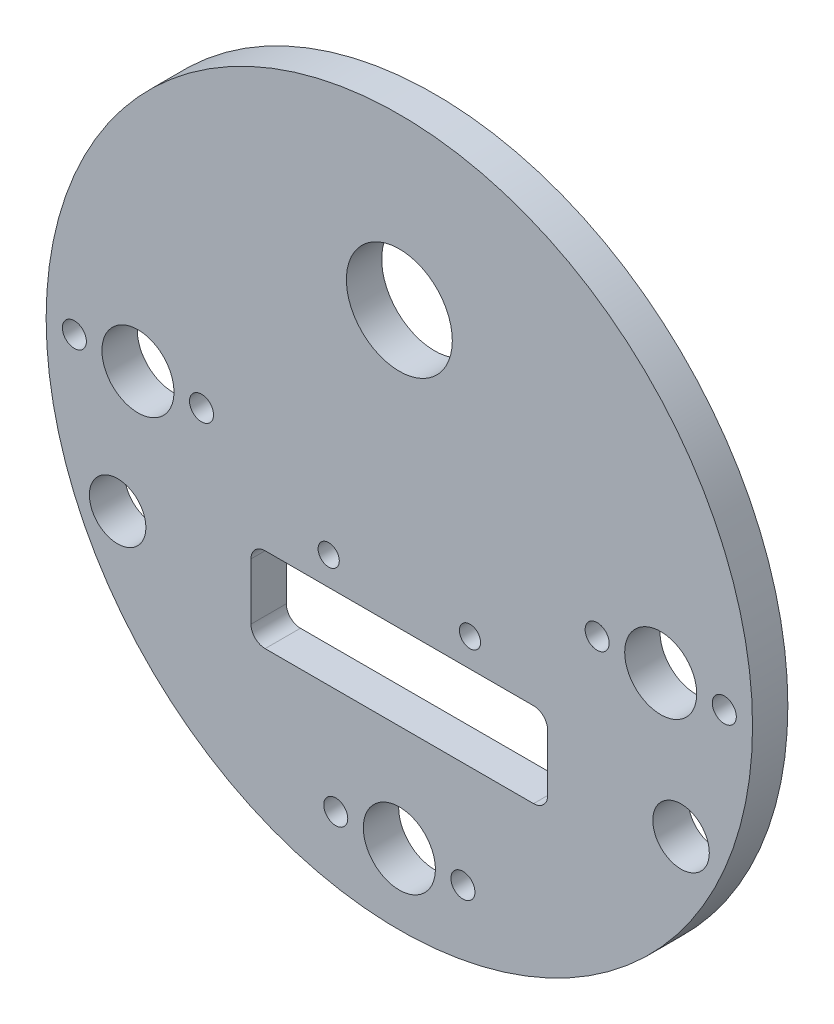
ISO-10303-21;
HEADER;
FILE_DESCRIPTION(('STEP AP214'),'2;1');
FILE_NAME('part.step','',(''),(''),'','','');
FILE_SCHEMA(('AUTOMOTIVE_DESIGN { 1 0 10303 214 1 1 1 1 }'));
ENDSEC;
DATA;
#1=APPLICATION_CONTEXT('core data for automotive mechanical design processes');
#2=APPLICATION_PROTOCOL_DEFINITION('international standard','automotive_design',2000,#1);
#3=PRODUCT_CONTEXT('',#1,'mechanical');
#4=PRODUCT('Part','Part','',(#3));
#5=PRODUCT_RELATED_PRODUCT_CATEGORY('part','',(#4));
#6=PRODUCT_DEFINITION_FORMATION('','',#4);
#7=PRODUCT_DEFINITION_CONTEXT('part definition',#1,'design');
#8=PRODUCT_DEFINITION('design','',#6,#7);
#9=PRODUCT_DEFINITION_SHAPE('','',#8);
#10=(LENGTH_UNIT() NAMED_UNIT(*) SI_UNIT(.MILLI.,.METRE.));
#11=(NAMED_UNIT(*) PLANE_ANGLE_UNIT() SI_UNIT($,.RADIAN.));
#12=(NAMED_UNIT(*) SI_UNIT($,.STERADIAN.) SOLID_ANGLE_UNIT());
#13=UNCERTAINTY_MEASURE_WITH_UNIT(LENGTH_MEASURE(1.E-05),#10,'distance_accuracy_value','');
#14=(GEOMETRIC_REPRESENTATION_CONTEXT(3) GLOBAL_UNCERTAINTY_ASSIGNED_CONTEXT((#13)) GLOBAL_UNIT_ASSIGNED_CONTEXT((#10,
#11,#12)) REPRESENTATION_CONTEXT('',''));
#15=CARTESIAN_POINT('',(0.,0.,0.));
#16=DIRECTION('',(0.,0.,1.));
#17=DIRECTION('',(1.,0.,0.));
#18=AXIS2_PLACEMENT_3D('',#15,#16,#17);
#19=CARTESIAN_POINT('',(0.,0.,5.));
#20=DIRECTION('',(0.,0.,-1.));
#21=DIRECTION('',(-1.,0.,0.));
#22=AXIS2_PLACEMENT_3D('',#19,#20,#21);
#23=CYLINDRICAL_SURFACE('',#22,50.);
#24=CARTESIAN_POINT('',(0.,0.,5.));
#25=DIRECTION('',(0.,0.,1.));
#26=DIRECTION('',(1.,0.,0.));
#27=AXIS2_PLACEMENT_3D('',#24,#25,#26);
#28=CIRCLE('',#27,50.);
#29=CARTESIAN_POINT('',(50.,0.,5.));
#30=VERTEX_POINT('',#29);
#31=EDGE_CURVE('E216',#30,#30,#28,.T.);
#32=ORIENTED_EDGE('',*,*,#31,.F.);
#33=EDGE_LOOP('',(#32));
#34=FACE_BOUND('',#33,.T.);
#35=CARTESIAN_POINT('',(0.,0.,0.));
#36=DIRECTION('',(0.,0.,1.));
#37=DIRECTION('',(1.,0.,0.));
#38=AXIS2_PLACEMENT_3D('',#35,#36,#37);
#39=CIRCLE('',#38,50.);
#40=CARTESIAN_POINT('',(50.,0.,0.));
#41=VERTEX_POINT('',#40);
#42=EDGE_CURVE('E215',#41,#41,#39,.T.);
#43=ORIENTED_EDGE('',*,*,#42,.T.);
#44=EDGE_LOOP('',(#43));
#45=FACE_BOUND('',#44,.T.);
#46=ADVANCED_FACE('F34',(#34,#45),#23,.T.);
#47=CARTESIAN_POINT('',(0.,0.,5.));
#48=DIRECTION('',(0.,0.,1.));
#49=DIRECTION('',(1.,0.,0.));
#50=AXIS2_PLACEMENT_3D('',#47,#48,#49);
#51=PLANE('',#50);
#52=CARTESIAN_POINT('',(-39.8775426296126,-18.5952035165907,5.));
#53=DIRECTION('',(0.,0.,1.));
#54=DIRECTION('',(1.,0.,0.));
#55=AXIS2_PLACEMENT_3D('',#52,#53,#54);
#56=CIRCLE('',#55,4.00000000000001);
#57=CARTESIAN_POINT('',(-35.8775426296126,-18.5952035165907,5.));
#58=VERTEX_POINT('',#57);
#59=EDGE_CURVE('E245',#58,#58,#56,.T.);
#60=ORIENTED_EDGE('',*,*,#59,.F.);
#61=EDGE_LOOP('',(#60));
#62=FACE_BOUND('',#61,.T.);
#63=CARTESIAN_POINT('',(39.8775426296126,-18.5952035165907,5.));
#64=DIRECTION('',(0.,0.,1.));
#65=DIRECTION('',(-1.,0.,0.));
#66=AXIS2_PLACEMENT_3D('',#63,#64,#65);
#67=CIRCLE('',#66,4.00000000000001);
#68=CARTESIAN_POINT('',(35.8775426296126,-18.5952035165907,5.));
#69=VERTEX_POINT('',#68);
#70=EDGE_CURVE('E250',#69,#69,#67,.T.);
#71=ORIENTED_EDGE('',*,*,#70,.F.);
#72=EDGE_LOOP('',(#71));
#73=FACE_BOUND('',#72,.T.);
#74=CARTESIAN_POINT('',(-19.,-15.,5.));
#75=DIRECTION('',(0.,0.,1.));
#76=DIRECTION('',(1.,0.,0.));
#77=AXIS2_PLACEMENT_3D('',#74,#75,#76);
#78=CIRCLE('',#77,2.);
#79=CARTESIAN_POINT('',(-19.,-13.,5.));
#80=VERTEX_POINT('',#79);
#81=CARTESIAN_POINT('',(-21.,-15.,5.));
#82=VERTEX_POINT('',#81);
#83=EDGE_CURVE('E50',#80,#82,#78,.T.);
#84=ORIENTED_EDGE('',*,*,#83,.F.);
#85=DIRECTION('',(-1.,0.,0.));
#86=VECTOR('',#85,1.);
#87=CARTESIAN_POINT('',(-19.,-13.,5.));
#88=LINE('',#87,#86);
#89=CARTESIAN_POINT('',(19.,-13.,5.));
#90=VERTEX_POINT('',#89);
#91=EDGE_CURVE('E134',#90,#80,#88,.T.);
#92=ORIENTED_EDGE('',*,*,#91,.F.);
#93=CARTESIAN_POINT('',(19.,-15.,5.));
#94=DIRECTION('',(0.,0.,1.));
#95=DIRECTION('',(1.,0.,0.));
#96=AXIS2_PLACEMENT_3D('',#93,#94,#95);
#97=CIRCLE('',#96,2.);
#98=CARTESIAN_POINT('',(21.,-15.,5.));
#99=VERTEX_POINT('',#98);
#100=EDGE_CURVE('E131',#99,#90,#97,.T.);
#101=ORIENTED_EDGE('',*,*,#100,.F.);
#102=DIRECTION('',(0.,1.,0.));
#103=VECTOR('',#102,1.);
#104=CARTESIAN_POINT('',(21.,-15.,5.));
#105=LINE('',#104,#103);
#106=CARTESIAN_POINT('',(21.,-23.,5.));
#107=VERTEX_POINT('',#106);
#108=EDGE_CURVE('E128',#107,#99,#105,.T.);
#109=ORIENTED_EDGE('',*,*,#108,.F.);
#110=CARTESIAN_POINT('',(19.,-23.,5.));
#111=DIRECTION('',(0.,0.,1.));
#112=DIRECTION('',(1.,0.,0.));
#113=AXIS2_PLACEMENT_3D('',#110,#111,#112);
#114=CIRCLE('',#113,2.);
#115=CARTESIAN_POINT('',(19.,-25.,5.));
#116=VERTEX_POINT('',#115);
#117=EDGE_CURVE('E122',#116,#107,#114,.T.);
#118=ORIENTED_EDGE('',*,*,#117,.F.);
#119=DIRECTION('',(1.,0.,0.));
#120=VECTOR('',#119,1.);
#121=CARTESIAN_POINT('',(-19.,-25.,5.));
#122=LINE('',#121,#120);
#123=CARTESIAN_POINT('',(-19.,-25.,5.));
#124=VERTEX_POINT('',#123);
#125=EDGE_CURVE('E120',#124,#116,#122,.T.);
#126=ORIENTED_EDGE('',*,*,#125,.F.);
#127=CARTESIAN_POINT('',(-19.,-23.,5.));
#128=DIRECTION('',(0.,0.,1.));
#129=DIRECTION('',(1.,0.,0.));
#130=AXIS2_PLACEMENT_3D('',#127,#128,#129);
#131=CIRCLE('',#130,2.);
#132=CARTESIAN_POINT('',(-21.,-23.,5.));
#133=VERTEX_POINT('',#132);
#134=EDGE_CURVE('E103',#133,#124,#131,.T.);
#135=ORIENTED_EDGE('',*,*,#134,.F.);
#136=DIRECTION('',(0.,-1.,0.));
#137=VECTOR('',#136,1.);
#138=CARTESIAN_POINT('',(-21.,-15.,5.));
#139=LINE('',#138,#137);
#140=EDGE_CURVE('E112',#82,#133,#139,.T.);
#141=ORIENTED_EDGE('',*,*,#140,.F.);
#142=EDGE_LOOP('',(#84,#92,#101,#109,#118,#126,#135,#141));
#143=FACE_BOUND('',#142,.T.);
#144=CARTESIAN_POINT('',(10.,-9.,5.));
#145=DIRECTION('',(0.,0.,1.));
#146=DIRECTION('',(1.,0.,0.));
#147=AXIS2_PLACEMENT_3D('',#144,#145,#146);
#148=CIRCLE('',#147,1.5);
#149=CARTESIAN_POINT('',(11.5,-9.,5.));
#150=VERTEX_POINT('',#149);
#151=EDGE_CURVE('E150',#150,#150,#148,.T.);
#152=ORIENTED_EDGE('',*,*,#151,.F.);
#153=EDGE_LOOP('',(#152));
#154=FACE_BOUND('',#153,.T.);
#155=CARTESIAN_POINT('',(-10.,-9.,5.));
#156=DIRECTION('',(0.,0.,1.));
#157=DIRECTION('',(1.,0.,0.));
#158=AXIS2_PLACEMENT_3D('',#155,#156,#157);
#159=CIRCLE('',#158,1.5);
#160=CARTESIAN_POINT('',(-8.5,-9.,5.));
#161=VERTEX_POINT('',#160);
#162=EDGE_CURVE('E153',#161,#161,#159,.T.);
#163=ORIENTED_EDGE('',*,*,#162,.F.);
#164=EDGE_LOOP('',(#163));
#165=FACE_BOUND('',#164,.T.);
#166=CARTESIAN_POINT('',(0.,26.,5.));
#167=DIRECTION('',(0.,0.,1.));
#168=DIRECTION('',(1.,0.,0.));
#169=AXIS2_PLACEMENT_3D('',#166,#167,#168);
#170=CIRCLE('',#169,7.5);
#171=CARTESIAN_POINT('',(7.5,26.,5.));
#172=VERTEX_POINT('',#171);
#173=EDGE_CURVE('E156',#172,#172,#170,.T.);
#174=ORIENTED_EDGE('',*,*,#173,.F.);
#175=EDGE_LOOP('',(#174));
#176=FACE_BOUND('',#175,.T.);
#177=CARTESIAN_POINT('',(46.,0.,5.));
#178=DIRECTION('',(0.,0.,1.));
#179=DIRECTION('',(1.,0.,0.));
#180=AXIS2_PLACEMENT_3D('',#177,#178,#179);
#181=CIRCLE('',#180,1.7);
#182=CARTESIAN_POINT('',(47.7,0.,5.));
#183=VERTEX_POINT('',#182);
#184=EDGE_CURVE('E161',#183,#183,#181,.T.);
#185=ORIENTED_EDGE('',*,*,#184,.F.);
#186=EDGE_LOOP('',(#185));
#187=FACE_BOUND('',#186,.T.);
#188=CARTESIAN_POINT('',(28.,0.,5.));
#189=DIRECTION('',(0.,0.,1.));
#190=DIRECTION('',(1.,0.,0.));
#191=AXIS2_PLACEMENT_3D('',#188,#189,#190);
#192=CIRCLE('',#191,1.7);
#193=CARTESIAN_POINT('',(29.7,0.,5.));
#194=VERTEX_POINT('',#193);
#195=EDGE_CURVE('E167',#194,#194,#192,.T.);
#196=ORIENTED_EDGE('',*,*,#195,.F.);
#197=EDGE_LOOP('',(#196));
#198=FACE_BOUND('',#197,.T.);
#199=CARTESIAN_POINT('',(9.,-40.,5.));
#200=DIRECTION('',(0.,0.,1.));
#201=DIRECTION('',(1.,0.,0.));
#202=AXIS2_PLACEMENT_3D('',#199,#200,#201);
#203=CIRCLE('',#202,1.7);
#204=CARTESIAN_POINT('',(10.7,-40.,5.));
#205=VERTEX_POINT('',#204);
#206=EDGE_CURVE('E173',#205,#205,#203,.T.);
#207=ORIENTED_EDGE('',*,*,#206,.F.);
#208=EDGE_LOOP('',(#207));
#209=FACE_BOUND('',#208,.T.);
#210=CARTESIAN_POINT('',(-9.,-40.,5.));
#211=DIRECTION('',(0.,0.,1.));
#212=DIRECTION('',(1.,0.,0.));
#213=AXIS2_PLACEMENT_3D('',#210,#211,#212);
#214=CIRCLE('',#213,1.7);
#215=CARTESIAN_POINT('',(-7.3,-40.,5.));
#216=VERTEX_POINT('',#215);
#217=EDGE_CURVE('E179',#216,#216,#214,.T.);
#218=ORIENTED_EDGE('',*,*,#217,.F.);
#219=EDGE_LOOP('',(#218));
#220=FACE_BOUND('',#219,.T.);
#221=CARTESIAN_POINT('',(-46.,2.97129651685814E-13,5.));
#222=DIRECTION('',(0.,0.,1.));
#223=DIRECTION('',(1.,0.,0.));
#224=AXIS2_PLACEMENT_3D('',#221,#222,#223);
#225=CIRCLE('',#224,1.7);
#226=CARTESIAN_POINT('',(-44.3,2.97129651685814E-13,5.));
#227=VERTEX_POINT('',#226);
#228=EDGE_CURVE('E185',#227,#227,#225,.T.);
#229=ORIENTED_EDGE('',*,*,#228,.F.);
#230=EDGE_LOOP('',(#229));
#231=FACE_BOUND('',#230,.T.);
#232=CARTESIAN_POINT('',(-28.,-1.71810817162361E-12,5.));
#233=DIRECTION('',(0.,0.,1.));
#234=DIRECTION('',(1.,0.,0.));
#235=AXIS2_PLACEMENT_3D('',#232,#233,#234);
#236=CIRCLE('',#235,1.7);
#237=CARTESIAN_POINT('',(-26.3,-1.71810817162361E-12,5.));
#238=VERTEX_POINT('',#237);
#239=EDGE_CURVE('E191',#238,#238,#236,.T.);
#240=ORIENTED_EDGE('',*,*,#239,.F.);
#241=EDGE_LOOP('',(#240));
#242=FACE_BOUND('',#241,.T.);
#243=CARTESIAN_POINT('',(-37.,0.,5.));
#244=DIRECTION('',(0.,0.,-1.));
#245=DIRECTION('',(-1.,0.,0.));
#246=AXIS2_PLACEMENT_3D('',#243,#244,#245);
#247=CIRCLE('',#246,5.1);
#248=CARTESIAN_POINT('',(-42.1,0.,5.));
#249=VERTEX_POINT('',#248);
#250=EDGE_CURVE('E200',#249,#249,#247,.T.);
#251=ORIENTED_EDGE('',*,*,#250,.T.);
#252=EDGE_LOOP('',(#251));
#253=FACE_BOUND('',#252,.T.);
#254=CARTESIAN_POINT('',(37.,2.68166793467571E-13,5.));
#255=DIRECTION('',(0.,0.,-1.));
#256=DIRECTION('',(-1.,0.,0.));
#257=AXIS2_PLACEMENT_3D('',#254,#255,#256);
#258=CIRCLE('',#257,5.1);
#259=CARTESIAN_POINT('',(31.9,2.68166793467571E-13,5.));
#260=VERTEX_POINT('',#259);
#261=EDGE_CURVE('E206',#260,#260,#258,.T.);
#262=ORIENTED_EDGE('',*,*,#261,.T.);
#263=EDGE_LOOP('',(#262));
#264=FACE_BOUND('',#263,.T.);
#265=CARTESIAN_POINT('',(0.,-40.,5.));
#266=DIRECTION('',(0.,0.,-1.));
#267=DIRECTION('',(-1.,0.,0.));
#268=AXIS2_PLACEMENT_3D('',#265,#266,#267);
#269=CIRCLE('',#268,5.1);
#270=CARTESIAN_POINT('',(-5.1,-40.,5.));
#271=VERTEX_POINT('',#270);
#272=EDGE_CURVE('E212',#271,#271,#269,.T.);
#273=ORIENTED_EDGE('',*,*,#272,.T.);
#274=EDGE_LOOP('',(#273));
#275=FACE_BOUND('',#274,.T.);
#276=ORIENTED_EDGE('',*,*,#31,.T.);
#277=EDGE_LOOP('',(#276));
#278=FACE_BOUND('',#277,.T.);
#279=ADVANCED_FACE('F116',(#62,#73,#143,#154,#165,#176,#187,#198,#209,#220,#231,#242,#253,#264,
#275,#278),#51,.T.);
#280=CARTESIAN_POINT('',(0.,0.,0.));
#281=DIRECTION('',(0.,0.,1.));
#282=DIRECTION('',(1.,0.,0.));
#283=AXIS2_PLACEMENT_3D('',#280,#281,#282);
#284=PLANE('',#283);
#285=CARTESIAN_POINT('',(-39.8775426296126,-18.5952035165907,0.));
#286=DIRECTION('',(0.,0.,1.));
#287=DIRECTION('',(1.,0.,0.));
#288=AXIS2_PLACEMENT_3D('',#285,#286,#287);
#289=CIRCLE('',#288,4.00000000000001);
#290=CARTESIAN_POINT('',(-35.8775426296126,-18.5952035165907,0.));
#291=VERTEX_POINT('',#290);
#292=EDGE_CURVE('E37',#291,#291,#289,.T.);
#293=ORIENTED_EDGE('',*,*,#292,.T.);
#294=EDGE_LOOP('',(#293));
#295=FACE_BOUND('',#294,.T.);
#296=CARTESIAN_POINT('',(39.8775426296126,-18.5952035165907,0.));
#297=DIRECTION('',(0.,0.,1.));
#298=DIRECTION('',(1.,0.,0.));
#299=AXIS2_PLACEMENT_3D('',#296,#297,#298);
#300=CIRCLE('',#299,4.00000000000001);
#301=CARTESIAN_POINT('',(43.8775426296126,-18.5952035165907,0.));
#302=VERTEX_POINT('',#301);
#303=EDGE_CURVE('E243',#302,#302,#300,.T.);
#304=ORIENTED_EDGE('',*,*,#303,.T.);
#305=EDGE_LOOP('',(#304));
#306=FACE_BOUND('',#305,.T.);
#307=DIRECTION('',(-1.,0.,0.));
#308=VECTOR('',#307,1.);
#309=CARTESIAN_POINT('',(0.,-13.,0.));
#310=LINE('',#309,#308);
#311=CARTESIAN_POINT('',(19.,-13.,0.));
#312=VERTEX_POINT('',#311);
#313=CARTESIAN_POINT('',(-19.,-13.,0.));
#314=VERTEX_POINT('',#313);
#315=EDGE_CURVE('E42',#312,#314,#310,.T.);
#316=ORIENTED_EDGE('',*,*,#315,.T.);
#317=CARTESIAN_POINT('',(-19.,-15.,0.));
#318=DIRECTION('',(0.,0.,1.));
#319=DIRECTION('',(1.,0.,0.));
#320=AXIS2_PLACEMENT_3D('',#317,#318,#319);
#321=CIRCLE('',#320,2.);
#322=CARTESIAN_POINT('',(-21.,-15.,0.));
#323=VERTEX_POINT('',#322);
#324=EDGE_CURVE('E11',#314,#323,#321,.T.);
#325=ORIENTED_EDGE('',*,*,#324,.T.);
#326=DIRECTION('',(0.,-1.,0.));
#327=VECTOR('',#326,1.);
#328=CARTESIAN_POINT('',(-21.,0.,0.));
#329=LINE('',#328,#327);
#330=CARTESIAN_POINT('',(-21.,-23.,0.));
#331=VERTEX_POINT('',#330);
#332=EDGE_CURVE('E219',#323,#331,#329,.T.);
#333=ORIENTED_EDGE('',*,*,#332,.T.);
#334=CARTESIAN_POINT('',(-19.,-23.,0.));
#335=DIRECTION('',(0.,0.,1.));
#336=DIRECTION('',(1.,0.,0.));
#337=AXIS2_PLACEMENT_3D('',#334,#335,#336);
#338=CIRCLE('',#337,2.);
#339=CARTESIAN_POINT('',(-19.,-25.,0.));
#340=VERTEX_POINT('',#339);
#341=EDGE_CURVE('E106',#331,#340,#338,.T.);
#342=ORIENTED_EDGE('',*,*,#341,.T.);
#343=DIRECTION('',(1.,0.,0.));
#344=VECTOR('',#343,1.);
#345=CARTESIAN_POINT('',(0.,-25.,0.));
#346=LINE('',#345,#344);
#347=CARTESIAN_POINT('',(19.,-25.,0.));
#348=VERTEX_POINT('',#347);
#349=EDGE_CURVE('E230',#340,#348,#346,.T.);
#350=ORIENTED_EDGE('',*,*,#349,.T.);
#351=CARTESIAN_POINT('',(19.,-23.,0.));
#352=DIRECTION('',(0.,0.,1.));
#353=DIRECTION('',(1.,0.,0.));
#354=AXIS2_PLACEMENT_3D('',#351,#352,#353);
#355=CIRCLE('',#354,2.);
#356=CARTESIAN_POINT('',(21.,-23.,0.));
#357=VERTEX_POINT('',#356);
#358=EDGE_CURVE('E233',#348,#357,#355,.T.);
#359=ORIENTED_EDGE('',*,*,#358,.T.);
#360=DIRECTION('',(0.,1.,0.));
#361=VECTOR('',#360,1.);
#362=CARTESIAN_POINT('',(21.,0.,0.));
#363=LINE('',#362,#361);
#364=CARTESIAN_POINT('',(21.,-15.,0.));
#365=VERTEX_POINT('',#364);
#366=EDGE_CURVE('E236',#357,#365,#363,.T.);
#367=ORIENTED_EDGE('',*,*,#366,.T.);
#368=CARTESIAN_POINT('',(19.,-15.,0.));
#369=DIRECTION('',(0.,0.,1.));
#370=DIRECTION('',(1.,0.,0.));
#371=AXIS2_PLACEMENT_3D('',#368,#369,#370);
#372=CIRCLE('',#371,2.);
#373=EDGE_CURVE('E239',#365,#312,#372,.T.);
#374=ORIENTED_EDGE('',*,*,#373,.T.);
#375=EDGE_LOOP('',(#316,#325,#333,#342,#350,#359,#367,#374));
#376=FACE_BOUND('',#375,.T.);
#377=CARTESIAN_POINT('',(10.,-9.,0.));
#378=DIRECTION('',(0.,0.,1.));
#379=DIRECTION('',(1.,0.,0.));
#380=AXIS2_PLACEMENT_3D('',#377,#378,#379);
#381=CIRCLE('',#380,1.5);
#382=CARTESIAN_POINT('',(11.5,-9.,0.));
#383=VERTEX_POINT('',#382);
#384=EDGE_CURVE('E160',#383,#383,#381,.T.);
#385=ORIENTED_EDGE('',*,*,#384,.T.);
#386=EDGE_LOOP('',(#385));
#387=FACE_BOUND('',#386,.T.);
#388=CARTESIAN_POINT('',(-10.,-9.,0.));
#389=DIRECTION('',(0.,0.,1.));
#390=DIRECTION('',(1.,0.,0.));
#391=AXIS2_PLACEMENT_3D('',#388,#389,#390);
#392=CIRCLE('',#391,1.5);
#393=CARTESIAN_POINT('',(-8.5,-9.,0.));
#394=VERTEX_POINT('',#393);
#395=EDGE_CURVE('E139',#394,#394,#392,.T.);
#396=ORIENTED_EDGE('',*,*,#395,.T.);
#397=EDGE_LOOP('',(#396));
#398=FACE_BOUND('',#397,.T.);
#399=CARTESIAN_POINT('',(0.,26.,0.));
#400=DIRECTION('',(0.,0.,1.));
#401=DIRECTION('',(1.,0.,0.));
#402=AXIS2_PLACEMENT_3D('',#399,#400,#401);
#403=CIRCLE('',#402,7.5);
#404=CARTESIAN_POINT('',(7.5,26.,0.));
#405=VERTEX_POINT('',#404);
#406=EDGE_CURVE('E159',#405,#405,#403,.T.);
#407=ORIENTED_EDGE('',*,*,#406,.T.);
#408=EDGE_LOOP('',(#407));
#409=FACE_BOUND('',#408,.T.);
#410=CARTESIAN_POINT('',(46.,0.,0.));
#411=DIRECTION('',(0.,0.,1.));
#412=DIRECTION('',(1.,0.,0.));
#413=AXIS2_PLACEMENT_3D('',#410,#411,#412);
#414=CIRCLE('',#413,1.7);
#415=CARTESIAN_POINT('',(47.7,0.,0.));
#416=VERTEX_POINT('',#415);
#417=EDGE_CURVE('E164',#416,#416,#414,.T.);
#418=ORIENTED_EDGE('',*,*,#417,.T.);
#419=EDGE_LOOP('',(#418));
#420=FACE_BOUND('',#419,.T.);
#421=CARTESIAN_POINT('',(28.,0.,0.));
#422=DIRECTION('',(0.,0.,1.));
#423=DIRECTION('',(1.,0.,0.));
#424=AXIS2_PLACEMENT_3D('',#421,#422,#423);
#425=CIRCLE('',#424,1.7);
#426=CARTESIAN_POINT('',(29.7,0.,0.));
#427=VERTEX_POINT('',#426);
#428=EDGE_CURVE('E170',#427,#427,#425,.T.);
#429=ORIENTED_EDGE('',*,*,#428,.T.);
#430=EDGE_LOOP('',(#429));
#431=FACE_BOUND('',#430,.T.);
#432=CARTESIAN_POINT('',(9.,-40.,0.));
#433=DIRECTION('',(0.,0.,1.));
#434=DIRECTION('',(1.,0.,0.));
#435=AXIS2_PLACEMENT_3D('',#432,#433,#434);
#436=CIRCLE('',#435,1.7);
#437=CARTESIAN_POINT('',(10.7,-40.,0.));
#438=VERTEX_POINT('',#437);
#439=EDGE_CURVE('E176',#438,#438,#436,.T.);
#440=ORIENTED_EDGE('',*,*,#439,.T.);
#441=EDGE_LOOP('',(#440));
#442=FACE_BOUND('',#441,.T.);
#443=CARTESIAN_POINT('',(-9.,-40.,0.));
#444=DIRECTION('',(0.,0.,1.));
#445=DIRECTION('',(1.,0.,0.));
#446=AXIS2_PLACEMENT_3D('',#443,#444,#445);
#447=CIRCLE('',#446,1.7);
#448=CARTESIAN_POINT('',(-7.3,-40.,0.));
#449=VERTEX_POINT('',#448);
#450=EDGE_CURVE('E182',#449,#449,#447,.T.);
#451=ORIENTED_EDGE('',*,*,#450,.T.);
#452=EDGE_LOOP('',(#451));
#453=FACE_BOUND('',#452,.T.);
#454=CARTESIAN_POINT('',(-46.,2.97129651685814E-13,0.));
#455=DIRECTION('',(0.,0.,1.));
#456=DIRECTION('',(1.,0.,0.));
#457=AXIS2_PLACEMENT_3D('',#454,#455,#456);
#458=CIRCLE('',#457,1.7);
#459=CARTESIAN_POINT('',(-44.3,2.97129651685814E-13,0.));
#460=VERTEX_POINT('',#459);
#461=EDGE_CURVE('E188',#460,#460,#458,.T.);
#462=ORIENTED_EDGE('',*,*,#461,.T.);
#463=EDGE_LOOP('',(#462));
#464=FACE_BOUND('',#463,.T.);
#465=CARTESIAN_POINT('',(-28.,-1.71810817162361E-12,0.));
#466=DIRECTION('',(0.,0.,1.));
#467=DIRECTION('',(1.,0.,0.));
#468=AXIS2_PLACEMENT_3D('',#465,#466,#467);
#469=CIRCLE('',#468,1.7);
#470=CARTESIAN_POINT('',(-26.3,-1.71810817162361E-12,0.));
#471=VERTEX_POINT('',#470);
#472=EDGE_CURVE('E194',#471,#471,#469,.T.);
#473=ORIENTED_EDGE('',*,*,#472,.T.);
#474=EDGE_LOOP('',(#473));
#475=FACE_BOUND('',#474,.T.);
#476=CARTESIAN_POINT('',(-37.,0.,0.));
#477=DIRECTION('',(0.,0.,-1.));
#478=DIRECTION('',(-1.,0.,0.));
#479=AXIS2_PLACEMENT_3D('',#476,#477,#478);
#480=CIRCLE('',#479,5.1);
#481=CARTESIAN_POINT('',(-42.1,0.,0.));
#482=VERTEX_POINT('',#481);
#483=EDGE_CURVE('E197',#482,#482,#480,.T.);
#484=ORIENTED_EDGE('',*,*,#483,.F.);
#485=EDGE_LOOP('',(#484));
#486=FACE_BOUND('',#485,.T.);
#487=CARTESIAN_POINT('',(37.,2.68166793467571E-13,0.));
#488=DIRECTION('',(0.,0.,-1.));
#489=DIRECTION('',(-1.,0.,0.));
#490=AXIS2_PLACEMENT_3D('',#487,#488,#489);
#491=CIRCLE('',#490,5.1);
#492=CARTESIAN_POINT('',(31.9,2.68166793467571E-13,0.));
#493=VERTEX_POINT('',#492);
#494=EDGE_CURVE('E203',#493,#493,#491,.T.);
#495=ORIENTED_EDGE('',*,*,#494,.F.);
#496=EDGE_LOOP('',(#495));
#497=FACE_BOUND('',#496,.T.);
#498=CARTESIAN_POINT('',(0.,-40.,0.));
#499=DIRECTION('',(0.,0.,-1.));
#500=DIRECTION('',(-1.,0.,0.));
#501=AXIS2_PLACEMENT_3D('',#498,#499,#500);
#502=CIRCLE('',#501,5.1);
#503=CARTESIAN_POINT('',(-5.1,-40.,0.));
#504=VERTEX_POINT('',#503);
#505=EDGE_CURVE('E209',#504,#504,#502,.T.);
#506=ORIENTED_EDGE('',*,*,#505,.F.);
#507=EDGE_LOOP('',(#506));
#508=FACE_BOUND('',#507,.T.);
#509=ORIENTED_EDGE('',*,*,#42,.F.);
#510=EDGE_LOOP('',(#509));
#511=FACE_BOUND('',#510,.T.);
#512=ADVANCED_FACE('F262',(#295,#306,#376,#387,#398,#409,#420,#431,#442,#453,#464,#475,#486,
#497,#508,#511),#284,.F.);
#513=CARTESIAN_POINT('',(0.,-40.,0.));
#514=DIRECTION('',(0.,0.,-1.));
#515=DIRECTION('',(-1.,0.,0.));
#516=AXIS2_PLACEMENT_3D('',#513,#514,#515);
#517=CYLINDRICAL_SURFACE('',#516,5.1);
#518=ORIENTED_EDGE('',*,*,#272,.F.);
#519=EDGE_LOOP('',(#518));
#520=FACE_BOUND('',#519,.T.);
#521=ORIENTED_EDGE('',*,*,#505,.T.);
#522=EDGE_LOOP('',(#521));
#523=FACE_BOUND('',#522,.T.);
#524=ADVANCED_FACE('F269',(#520,#523),#517,.F.);
#525=CARTESIAN_POINT('',(37.,2.68166793467571E-13,0.));
#526=DIRECTION('',(0.,0.,-1.));
#527=DIRECTION('',(-1.,0.,0.));
#528=AXIS2_PLACEMENT_3D('',#525,#526,#527);
#529=CYLINDRICAL_SURFACE('',#528,5.1);
#530=ORIENTED_EDGE('',*,*,#261,.F.);
#531=EDGE_LOOP('',(#530));
#532=FACE_BOUND('',#531,.T.);
#533=ORIENTED_EDGE('',*,*,#494,.T.);
#534=EDGE_LOOP('',(#533));
#535=FACE_BOUND('',#534,.T.);
#536=ADVANCED_FACE('F275',(#532,#535),#529,.F.);
#537=CARTESIAN_POINT('',(-37.,0.,0.));
#538=DIRECTION('',(0.,0.,-1.));
#539=DIRECTION('',(-1.,0.,0.));
#540=AXIS2_PLACEMENT_3D('',#537,#538,#539);
#541=CYLINDRICAL_SURFACE('',#540,5.1);
#542=ORIENTED_EDGE('',*,*,#250,.F.);
#543=EDGE_LOOP('',(#542));
#544=FACE_BOUND('',#543,.T.);
#545=ORIENTED_EDGE('',*,*,#483,.T.);
#546=EDGE_LOOP('',(#545));
#547=FACE_BOUND('',#546,.T.);
#548=ADVANCED_FACE('F279',(#544,#547),#541,.F.);
#549=CARTESIAN_POINT('',(-28.,-1.71810817162361E-12,5.));
#550=DIRECTION('',(0.,0.,1.));
#551=DIRECTION('',(1.,0.,0.));
#552=AXIS2_PLACEMENT_3D('',#549,#550,#551);
#553=CYLINDRICAL_SURFACE('',#552,1.7);
#554=ORIENTED_EDGE('',*,*,#472,.F.);
#555=EDGE_LOOP('',(#554));
#556=FACE_BOUND('',#555,.T.);
#557=ORIENTED_EDGE('',*,*,#239,.T.);
#558=EDGE_LOOP('',(#557));
#559=FACE_BOUND('',#558,.T.);
#560=ADVANCED_FACE('F283',(#556,#559),#553,.F.);
#561=CARTESIAN_POINT('',(-46.,2.97129651685814E-13,5.));
#562=DIRECTION('',(0.,0.,1.));
#563=DIRECTION('',(1.,0.,0.));
#564=AXIS2_PLACEMENT_3D('',#561,#562,#563);
#565=CYLINDRICAL_SURFACE('',#564,1.7);
#566=ORIENTED_EDGE('',*,*,#461,.F.);
#567=EDGE_LOOP('',(#566));
#568=FACE_BOUND('',#567,.T.);
#569=ORIENTED_EDGE('',*,*,#228,.T.);
#570=EDGE_LOOP('',(#569));
#571=FACE_BOUND('',#570,.T.);
#572=ADVANCED_FACE('F287',(#568,#571),#565,.F.);
#573=CARTESIAN_POINT('',(-9.,-40.,5.));
#574=DIRECTION('',(0.,0.,1.));
#575=DIRECTION('',(1.,0.,0.));
#576=AXIS2_PLACEMENT_3D('',#573,#574,#575);
#577=CYLINDRICAL_SURFACE('',#576,1.7);
#578=ORIENTED_EDGE('',*,*,#450,.F.);
#579=EDGE_LOOP('',(#578));
#580=FACE_BOUND('',#579,.T.);
#581=ORIENTED_EDGE('',*,*,#217,.T.);
#582=EDGE_LOOP('',(#581));
#583=FACE_BOUND('',#582,.T.);
#584=ADVANCED_FACE('F291',(#580,#583),#577,.F.);
#585=CARTESIAN_POINT('',(9.,-40.,5.));
#586=DIRECTION('',(0.,0.,1.));
#587=DIRECTION('',(1.,0.,0.));
#588=AXIS2_PLACEMENT_3D('',#585,#586,#587);
#589=CYLINDRICAL_SURFACE('',#588,1.7);
#590=ORIENTED_EDGE('',*,*,#439,.F.);
#591=EDGE_LOOP('',(#590));
#592=FACE_BOUND('',#591,.T.);
#593=ORIENTED_EDGE('',*,*,#206,.T.);
#594=EDGE_LOOP('',(#593));
#595=FACE_BOUND('',#594,.T.);
#596=ADVANCED_FACE('F295',(#592,#595),#589,.F.);
#597=CARTESIAN_POINT('',(28.,0.,5.));
#598=DIRECTION('',(0.,0.,1.));
#599=DIRECTION('',(1.,0.,0.));
#600=AXIS2_PLACEMENT_3D('',#597,#598,#599);
#601=CYLINDRICAL_SURFACE('',#600,1.7);
#602=ORIENTED_EDGE('',*,*,#428,.F.);
#603=EDGE_LOOP('',(#602));
#604=FACE_BOUND('',#603,.T.);
#605=ORIENTED_EDGE('',*,*,#195,.T.);
#606=EDGE_LOOP('',(#605));
#607=FACE_BOUND('',#606,.T.);
#608=ADVANCED_FACE('F299',(#604,#607),#601,.F.);
#609=CARTESIAN_POINT('',(46.,0.,5.));
#610=DIRECTION('',(0.,0.,1.));
#611=DIRECTION('',(1.,0.,0.));
#612=AXIS2_PLACEMENT_3D('',#609,#610,#611);
#613=CYLINDRICAL_SURFACE('',#612,1.7);
#614=ORIENTED_EDGE('',*,*,#417,.F.);
#615=EDGE_LOOP('',(#614));
#616=FACE_BOUND('',#615,.T.);
#617=ORIENTED_EDGE('',*,*,#184,.T.);
#618=EDGE_LOOP('',(#617));
#619=FACE_BOUND('',#618,.T.);
#620=ADVANCED_FACE('F303',(#616,#619),#613,.F.);
#621=CARTESIAN_POINT('',(0.,26.,-5.));
#622=DIRECTION('',(0.,0.,1.));
#623=DIRECTION('',(1.,0.,0.));
#624=AXIS2_PLACEMENT_3D('',#621,#622,#623);
#625=CYLINDRICAL_SURFACE('',#624,7.5);
#626=ORIENTED_EDGE('',*,*,#173,.T.);
#627=EDGE_LOOP('',(#626));
#628=FACE_BOUND('',#627,.T.);
#629=ORIENTED_EDGE('',*,*,#406,.F.);
#630=EDGE_LOOP('',(#629));
#631=FACE_BOUND('',#630,.T.);
#632=ADVANCED_FACE('F307',(#628,#631),#625,.F.);
#633=CARTESIAN_POINT('',(-10.,-9.,-5.));
#634=DIRECTION('',(0.,0.,1.));
#635=DIRECTION('',(1.,0.,0.));
#636=AXIS2_PLACEMENT_3D('',#633,#634,#635);
#637=CYLINDRICAL_SURFACE('',#636,1.5);
#638=ORIENTED_EDGE('',*,*,#162,.T.);
#639=EDGE_LOOP('',(#638));
#640=FACE_BOUND('',#639,.T.);
#641=ORIENTED_EDGE('',*,*,#395,.F.);
#642=EDGE_LOOP('',(#641));
#643=FACE_BOUND('',#642,.T.);
#644=ADVANCED_FACE('F311',(#640,#643),#637,.F.);
#645=CARTESIAN_POINT('',(10.,-9.,-5.));
#646=DIRECTION('',(0.,0.,1.));
#647=DIRECTION('',(1.,0.,0.));
#648=AXIS2_PLACEMENT_3D('',#645,#646,#647);
#649=CYLINDRICAL_SURFACE('',#648,1.5);
#650=ORIENTED_EDGE('',*,*,#151,.T.);
#651=EDGE_LOOP('',(#650));
#652=FACE_BOUND('',#651,.T.);
#653=ORIENTED_EDGE('',*,*,#384,.F.);
#654=EDGE_LOOP('',(#653));
#655=FACE_BOUND('',#654,.T.);
#656=ADVANCED_FACE('F315',(#652,#655),#649,.F.);
#657=CARTESIAN_POINT('',(-19.,-15.,-5.));
#658=DIRECTION('',(0.,0.,1.));
#659=DIRECTION('',(1.,0.,0.));
#660=AXIS2_PLACEMENT_3D('',#657,#658,#659);
#661=CYLINDRICAL_SURFACE('',#660,2.);
#662=DIRECTION('',(0.,0.,1.));
#663=VECTOR('',#662,1.);
#664=CARTESIAN_POINT('',(-19.,-13.,-5.));
#665=LINE('',#664,#663);
#666=EDGE_CURVE('E137',#314,#80,#665,.T.);
#667=ORIENTED_EDGE('',*,*,#666,.T.);
#668=ORIENTED_EDGE('',*,*,#83,.T.);
#669=DIRECTION('',(0.,0.,1.));
#670=VECTOR('',#669,1.);
#671=CARTESIAN_POINT('',(-21.,-15.,-5.));
#672=LINE('',#671,#670);
#673=EDGE_CURVE('E109',#323,#82,#672,.T.);
#674=ORIENTED_EDGE('',*,*,#673,.F.);
#675=ORIENTED_EDGE('',*,*,#324,.F.);
#676=EDGE_LOOP('',(#667,#668,#674,#675));
#677=FACE_BOUND('',#676,.T.);
#678=ADVANCED_FACE('F319',(#677),#661,.F.);
#679=CARTESIAN_POINT('',(-19.,-13.,-5.));
#680=DIRECTION('',(0.,1.,0.));
#681=DIRECTION('',(-1.,0.,0.));
#682=AXIS2_PLACEMENT_3D('',#679,#680,#681);
#683=PLANE('',#682);
#684=DIRECTION('',(0.,0.,1.));
#685=VECTOR('',#684,1.);
#686=CARTESIAN_POINT('',(19.,-13.,-5.));
#687=LINE('',#686,#685);
#688=EDGE_CURVE('E140',#312,#90,#687,.T.);
#689=ORIENTED_EDGE('',*,*,#688,.T.);
#690=ORIENTED_EDGE('',*,*,#91,.T.);
#691=ORIENTED_EDGE('',*,*,#666,.F.);
#692=ORIENTED_EDGE('',*,*,#315,.F.);
#693=EDGE_LOOP('',(#689,#690,#691,#692));
#694=FACE_BOUND('',#693,.T.);
#695=ADVANCED_FACE('F323',(#694),#683,.F.);
#696=CARTESIAN_POINT('',(19.,-15.,-5.));
#697=DIRECTION('',(0.,0.,1.));
#698=DIRECTION('',(1.,0.,0.));
#699=AXIS2_PLACEMENT_3D('',#696,#697,#698);
#700=CYLINDRICAL_SURFACE('',#699,2.);
#701=DIRECTION('',(0.,0.,1.));
#702=VECTOR('',#701,1.);
#703=CARTESIAN_POINT('',(21.,-15.,-5.));
#704=LINE('',#703,#702);
#705=EDGE_CURVE('E142',#365,#99,#704,.T.);
#706=ORIENTED_EDGE('',*,*,#705,.T.);
#707=ORIENTED_EDGE('',*,*,#100,.T.);
#708=ORIENTED_EDGE('',*,*,#688,.F.);
#709=ORIENTED_EDGE('',*,*,#373,.F.);
#710=EDGE_LOOP('',(#706,#707,#708,#709));
#711=FACE_BOUND('',#710,.T.);
#712=ADVANCED_FACE('F339',(#711),#700,.F.);
#713=CARTESIAN_POINT('',(21.,-15.,-5.));
#714=DIRECTION('',(1.,0.,0.));
#715=DIRECTION('',(0.,1.,0.));
#716=AXIS2_PLACEMENT_3D('',#713,#714,#715);
#717=PLANE('',#716);
#718=DIRECTION('',(0.,0.,1.));
#719=VECTOR('',#718,1.);
#720=CARTESIAN_POINT('',(21.,-23.,-5.));
#721=LINE('',#720,#719);
#722=EDGE_CURVE('E144',#357,#107,#721,.T.);
#723=ORIENTED_EDGE('',*,*,#722,.T.);
#724=ORIENTED_EDGE('',*,*,#108,.T.);
#725=ORIENTED_EDGE('',*,*,#705,.F.);
#726=ORIENTED_EDGE('',*,*,#366,.F.);
#727=EDGE_LOOP('',(#723,#724,#725,#726));
#728=FACE_BOUND('',#727,.T.);
#729=ADVANCED_FACE('F335',(#728),#717,.F.);
#730=CARTESIAN_POINT('',(19.,-23.,-5.));
#731=DIRECTION('',(0.,0.,1.));
#732=DIRECTION('',(1.,0.,0.));
#733=AXIS2_PLACEMENT_3D('',#730,#731,#732);
#734=CYLINDRICAL_SURFACE('',#733,2.);
#735=DIRECTION('',(0.,0.,1.));
#736=VECTOR('',#735,1.);
#737=CARTESIAN_POINT('',(19.,-25.,-5.));
#738=LINE('',#737,#736);
#739=EDGE_CURVE('E146',#348,#116,#738,.T.);
#740=ORIENTED_EDGE('',*,*,#739,.T.);
#741=ORIENTED_EDGE('',*,*,#117,.T.);
#742=ORIENTED_EDGE('',*,*,#722,.F.);
#743=ORIENTED_EDGE('',*,*,#358,.F.);
#744=EDGE_LOOP('',(#740,#741,#742,#743));
#745=FACE_BOUND('',#744,.T.);
#746=ADVANCED_FACE('F331',(#745),#734,.F.);
#747=CARTESIAN_POINT('',(-19.,-25.,-5.));
#748=DIRECTION('',(0.,-1.,0.));
#749=DIRECTION('',(1.,0.,0.));
#750=AXIS2_PLACEMENT_3D('',#747,#748,#749);
#751=PLANE('',#750);
#752=DIRECTION('',(0.,0.,1.));
#753=VECTOR('',#752,1.);
#754=CARTESIAN_POINT('',(-19.,-25.,-5.));
#755=LINE('',#754,#753);
#756=EDGE_CURVE('E108',#340,#124,#755,.T.);
#757=ORIENTED_EDGE('',*,*,#756,.T.);
#758=ORIENTED_EDGE('',*,*,#125,.T.);
#759=ORIENTED_EDGE('',*,*,#739,.F.);
#760=ORIENTED_EDGE('',*,*,#349,.F.);
#761=EDGE_LOOP('',(#757,#758,#759,#760));
#762=FACE_BOUND('',#761,.T.);
#763=ADVANCED_FACE('F328',(#762),#751,.F.);
#764=CARTESIAN_POINT('',(-19.,-23.,-5.));
#765=DIRECTION('',(0.,0.,1.));
#766=DIRECTION('',(1.,0.,0.));
#767=AXIS2_PLACEMENT_3D('',#764,#765,#766);
#768=CYLINDRICAL_SURFACE('',#767,2.);
#769=DIRECTION('',(0.,0.,1.));
#770=VECTOR('',#769,1.);
#771=CARTESIAN_POINT('',(-21.,-23.,-5.));
#772=LINE('',#771,#770);
#773=EDGE_CURVE('E58',#331,#133,#772,.T.);
#774=ORIENTED_EDGE('',*,*,#773,.T.);
#775=ORIENTED_EDGE('',*,*,#134,.T.);
#776=ORIENTED_EDGE('',*,*,#756,.F.);
#777=ORIENTED_EDGE('',*,*,#341,.F.);
#778=EDGE_LOOP('',(#774,#775,#776,#777));
#779=FACE_BOUND('',#778,.T.);
#780=ADVANCED_FACE('F100',(#779),#768,.F.);
#781=CARTESIAN_POINT('',(-21.,-15.,-5.));
#782=DIRECTION('',(-1.,0.,0.));
#783=DIRECTION('',(0.,-1.,0.));
#784=AXIS2_PLACEMENT_3D('',#781,#782,#783);
#785=PLANE('',#784);
#786=ORIENTED_EDGE('',*,*,#673,.T.);
#787=ORIENTED_EDGE('',*,*,#140,.T.);
#788=ORIENTED_EDGE('',*,*,#773,.F.);
#789=ORIENTED_EDGE('',*,*,#332,.F.);
#790=EDGE_LOOP('',(#786,#787,#788,#789));
#791=FACE_BOUND('',#790,.T.);
#792=ADVANCED_FACE('F113',(#791),#785,.F.);
#793=CARTESIAN_POINT('',(39.8775426296126,-18.5952035165907,-5.));
#794=DIRECTION('',(0.,0.,1.));
#795=DIRECTION('',(1.,0.,0.));
#796=AXIS2_PLACEMENT_3D('',#793,#794,#795);
#797=CYLINDRICAL_SURFACE('',#796,4.00000000000001);
#798=ORIENTED_EDGE('',*,*,#70,.T.);
#799=EDGE_LOOP('',(#798));
#800=FACE_BOUND('',#799,.T.);
#801=ORIENTED_EDGE('',*,*,#303,.F.);
#802=EDGE_LOOP('',(#801));
#803=FACE_BOUND('',#802,.T.);
#804=ADVANCED_FACE('F258',(#800,#803),#797,.F.);
#805=CARTESIAN_POINT('',(-39.8775426296126,-18.5952035165907,-5.));
#806=DIRECTION('',(0.,0.,1.));
#807=DIRECTION('',(1.,0.,0.));
#808=AXIS2_PLACEMENT_3D('',#805,#806,#807);
#809=CYLINDRICAL_SURFACE('',#808,4.00000000000001);
#810=ORIENTED_EDGE('',*,*,#59,.T.);
#811=EDGE_LOOP('',(#810));
#812=FACE_BOUND('',#811,.T.);
#813=ORIENTED_EDGE('',*,*,#292,.F.);
#814=EDGE_LOOP('',(#813));
#815=FACE_BOUND('',#814,.T.);
#816=ADVANCED_FACE('F349',(#812,#815),#809,.F.);
#817=CLOSED_SHELL('',(#46,#279,#512,#524,#536,#548,#560,#572,#584,#596,#608,#620,#632,#644,#656,
#678,#695,#712,#729,#746,#763,#780,#792,#804,#816));
#818=MANIFOLD_SOLID_BREP('B2',#817);
#819=ADVANCED_BREP_SHAPE_REPRESENTATION('',(#18,#818),#14);
#820=SHAPE_DEFINITION_REPRESENTATION(#9,#819);
ENDSEC;
END-ISO-10303-21;
